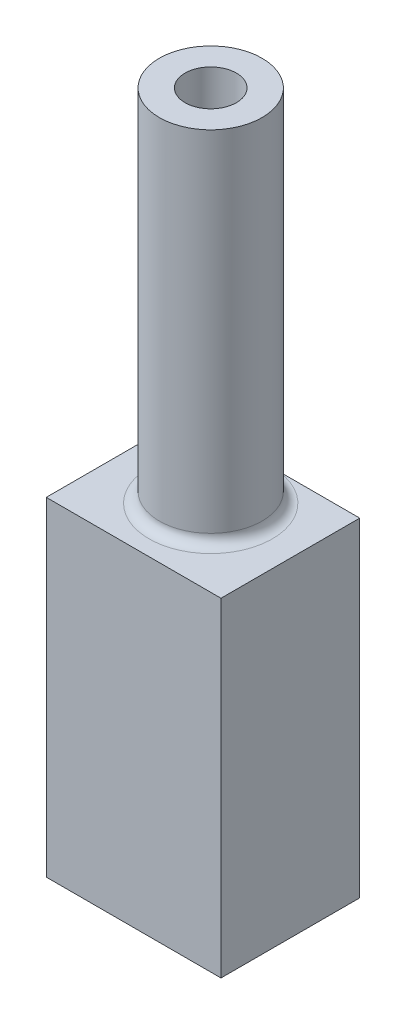
ISO-10303-21;
HEADER;
FILE_DESCRIPTION(('STEP AP214'),'2;1');
FILE_NAME('part.step','',(''),(''),'','','');
FILE_SCHEMA(('AUTOMOTIVE_DESIGN { 1 0 10303 214 1 1 1 1 }'));
ENDSEC;
DATA;
#1=APPLICATION_CONTEXT('core data for automotive mechanical design processes');
#2=APPLICATION_PROTOCOL_DEFINITION('international standard','automotive_design',2000,#1);
#3=PRODUCT_CONTEXT('',#1,'mechanical');
#4=PRODUCT('Part','Part','',(#3));
#5=PRODUCT_RELATED_PRODUCT_CATEGORY('part','',(#4));
#6=PRODUCT_DEFINITION_FORMATION('','',#4);
#7=PRODUCT_DEFINITION_CONTEXT('part definition',#1,'design');
#8=PRODUCT_DEFINITION('design','',#6,#7);
#9=PRODUCT_DEFINITION_SHAPE('','',#8);
#10=(LENGTH_UNIT() NAMED_UNIT(*) SI_UNIT(.MILLI.,.METRE.));
#11=(NAMED_UNIT(*) PLANE_ANGLE_UNIT() SI_UNIT($,.RADIAN.));
#12=(NAMED_UNIT(*) SI_UNIT($,.STERADIAN.) SOLID_ANGLE_UNIT());
#13=UNCERTAINTY_MEASURE_WITH_UNIT(LENGTH_MEASURE(1.E-05),#10,'distance_accuracy_value','');
#14=(GEOMETRIC_REPRESENTATION_CONTEXT(3) GLOBAL_UNCERTAINTY_ASSIGNED_CONTEXT((#13)) GLOBAL_UNIT_ASSIGNED_CONTEXT((#10,
#11,#12)) REPRESENTATION_CONTEXT('',''));
#15=CARTESIAN_POINT('',(0.,0.,0.));
#16=DIRECTION('',(0.,0.,1.));
#17=DIRECTION('',(1.,0.,0.));
#18=AXIS2_PLACEMENT_3D('',#15,#16,#17);
#19=CARTESIAN_POINT('',(8.5,-16.,6.));
#20=DIRECTION('',(-1.,0.,0.));
#21=DIRECTION('',(0.,0.,1.));
#22=AXIS2_PLACEMENT_3D('',#19,#20,#21);
#23=PLANE('',#22);
#24=DIRECTION('',(0.,1.,0.));
#25=VECTOR('',#24,1.);
#26=CARTESIAN_POINT('',(8.5,-16.,-6.));
#27=LINE('',#26,#25);
#28=CARTESIAN_POINT('',(8.5,-16.,-6.));
#29=VERTEX_POINT('',#28);
#30=CARTESIAN_POINT('',(8.5,16.,-6.));
#31=VERTEX_POINT('',#30);
#32=EDGE_CURVE('E161',#29,#31,#27,.T.);
#33=ORIENTED_EDGE('',*,*,#32,.T.);
#34=DIRECTION('',(0.,0.,-1.));
#35=VECTOR('',#34,1.);
#36=CARTESIAN_POINT('',(8.5,16.,6.));
#37=LINE('',#36,#35);
#38=CARTESIAN_POINT('',(8.5,16.,7.5));
#39=VERTEX_POINT('',#38);
#40=EDGE_CURVE('E207',#39,#31,#37,.T.);
#41=ORIENTED_EDGE('',*,*,#40,.F.);
#42=DIRECTION('',(0.,1.,0.));
#43=VECTOR('',#42,1.);
#44=CARTESIAN_POINT('',(8.5,16.,7.5));
#45=LINE('',#44,#43);
#46=CARTESIAN_POINT('',(8.5,-16.,7.5));
#47=VERTEX_POINT('',#46);
#48=EDGE_CURVE('E296',#47,#39,#45,.T.);
#49=ORIENTED_EDGE('',*,*,#48,.F.);
#50=DIRECTION('',(0.,0.,-1.));
#51=VECTOR('',#50,1.);
#52=CARTESIAN_POINT('',(8.5,-16.,6.));
#53=LINE('',#52,#51);
#54=EDGE_CURVE('E160',#47,#29,#53,.T.);
#55=ORIENTED_EDGE('',*,*,#54,.T.);
#56=EDGE_LOOP('',(#33,#41,#49,#55));
#57=FACE_BOUND('',#56,.T.);
#58=ADVANCED_FACE('F37',(#57),#23,.F.);
#59=CARTESIAN_POINT('',(-8.5,16.,6.));
#60=DIRECTION('',(0.,-1.,0.));
#61=DIRECTION('',(0.,0.,-1.));
#62=AXIS2_PLACEMENT_3D('',#59,#60,#61);
#63=PLANE('',#62);
#64=DIRECTION('',(-1.,0.,0.));
#65=VECTOR('',#64,1.);
#66=CARTESIAN_POINT('',(-8.5,16.,-6.));
#67=LINE('',#66,#65);
#68=CARTESIAN_POINT('',(0.,16.,-6.));
#69=VERTEX_POINT('',#68);
#70=EDGE_CURVE('E166',#31,#69,#67,.T.);
#71=ORIENTED_EDGE('',*,*,#70,.T.);
#72=CARTESIAN_POINT('',(0.,16.,0.));
#73=DIRECTION('',(0.,-1.,0.));
#74=DIRECTION('',(0.,0.,-1.));
#75=AXIS2_PLACEMENT_3D('',#72,#73,#74);
#76=CIRCLE('',#75,6.);
#77=EDGE_CURVE('E11',#69,#69,#76,.T.);
#78=ORIENTED_EDGE('',*,*,#77,.T.);
#79=CARTESIAN_POINT('',(-8.5,16.,-6.));
#80=VERTEX_POINT('',#79);
#81=EDGE_CURVE('E164',#69,#80,#67,.T.);
#82=ORIENTED_EDGE('',*,*,#81,.T.);
#83=DIRECTION('',(0.,0.,-1.));
#84=VECTOR('',#83,1.);
#85=CARTESIAN_POINT('',(-8.5,16.,6.));
#86=LINE('',#85,#84);
#87=CARTESIAN_POINT('',(-8.5,16.,7.5));
#88=VERTEX_POINT('',#87);
#89=EDGE_CURVE('E204',#88,#80,#86,.T.);
#90=ORIENTED_EDGE('',*,*,#89,.F.);
#91=DIRECTION('',(-1.,0.,0.));
#92=VECTOR('',#91,1.);
#93=CARTESIAN_POINT('',(-8.5,16.,7.5));
#94=LINE('',#93,#92);
#95=EDGE_CURVE('E299',#39,#88,#94,.T.);
#96=ORIENTED_EDGE('',*,*,#95,.F.);
#97=ORIENTED_EDGE('',*,*,#40,.T.);
#98=EDGE_LOOP('',(#71,#78,#82,#90,#96,#97));
#99=FACE_BOUND('',#98,.T.);
#100=ADVANCED_FACE('F227',(#99),#63,.F.);
#101=CARTESIAN_POINT('',(-8.5,-16.,6.));
#102=DIRECTION('',(1.,0.,0.));
#103=DIRECTION('',(0.,0.,-1.));
#104=AXIS2_PLACEMENT_3D('',#101,#102,#103);
#105=PLANE('',#104);
#106=DIRECTION('',(0.,-1.,0.));
#107=VECTOR('',#106,1.);
#108=CARTESIAN_POINT('',(-8.5,-16.,-6.));
#109=LINE('',#108,#107);
#110=CARTESIAN_POINT('',(-8.5,-16.,-6.));
#111=VERTEX_POINT('',#110);
#112=EDGE_CURVE('E168',#80,#111,#109,.T.);
#113=ORIENTED_EDGE('',*,*,#112,.T.);
#114=DIRECTION('',(0.,0.,-1.));
#115=VECTOR('',#114,1.);
#116=CARTESIAN_POINT('',(-8.5,-16.,6.));
#117=LINE('',#116,#115);
#118=CARTESIAN_POINT('',(-8.5,-16.,7.5));
#119=VERTEX_POINT('',#118);
#120=EDGE_CURVE('E201',#119,#111,#117,.T.);
#121=ORIENTED_EDGE('',*,*,#120,.F.);
#122=DIRECTION('',(0.,-1.,0.));
#123=VECTOR('',#122,1.);
#124=CARTESIAN_POINT('',(-8.5,16.,7.5));
#125=LINE('',#124,#123);
#126=EDGE_CURVE('E287',#88,#119,#125,.T.);
#127=ORIENTED_EDGE('',*,*,#126,.F.);
#128=ORIENTED_EDGE('',*,*,#89,.T.);
#129=EDGE_LOOP('',(#113,#121,#127,#128));
#130=FACE_BOUND('',#129,.T.);
#131=ADVANCED_FACE('F232',(#130),#105,.F.);
#132=CARTESIAN_POINT('',(-4.5,-14.,6.));
#133=DIRECTION('',(-1.,0.,0.));
#134=DIRECTION('',(0.,0.,1.));
#135=AXIS2_PLACEMENT_3D('',#132,#133,#134);
#136=PLANE('',#135);
#137=DIRECTION('',(0.,1.,0.));
#138=VECTOR('',#137,1.);
#139=CARTESIAN_POINT('',(-4.5,-14.,-6.));
#140=LINE('',#139,#138);
#141=CARTESIAN_POINT('',(-4.5,-16.,-6.));
#142=VERTEX_POINT('',#141);
#143=CARTESIAN_POINT('',(-4.5,-14.,-6.));
#144=VERTEX_POINT('',#143);
#145=EDGE_CURVE('E172',#142,#144,#140,.T.);
#146=ORIENTED_EDGE('',*,*,#145,.T.);
#147=DIRECTION('',(0.,0.,-1.));
#148=VECTOR('',#147,1.);
#149=CARTESIAN_POINT('',(-4.5,-14.,6.));
#150=LINE('',#149,#148);
#151=CARTESIAN_POINT('',(-4.5,-14.,6.));
#152=VERTEX_POINT('',#151);
#153=EDGE_CURVE('E197',#152,#144,#150,.T.);
#154=ORIENTED_EDGE('',*,*,#153,.F.);
#155=DIRECTION('',(0.,1.,0.));
#156=VECTOR('',#155,1.);
#157=CARTESIAN_POINT('',(-4.5,-14.,6.));
#158=LINE('',#157,#156);
#159=CARTESIAN_POINT('',(-4.5,-16.,6.));
#160=VERTEX_POINT('',#159);
#161=EDGE_CURVE('E186',#160,#152,#158,.T.);
#162=ORIENTED_EDGE('',*,*,#161,.F.);
#163=DIRECTION('',(0.,0.,-1.));
#164=VECTOR('',#163,1.);
#165=CARTESIAN_POINT('',(-4.5,-16.,6.));
#166=LINE('',#165,#164);
#167=EDGE_CURVE('E109',#160,#142,#166,.T.);
#168=ORIENTED_EDGE('',*,*,#167,.T.);
#169=EDGE_LOOP('',(#146,#154,#162,#168));
#170=FACE_BOUND('',#169,.T.);
#171=ADVANCED_FACE('F237',(#170),#136,.F.);
#172=CARTESIAN_POINT('',(-6.5,-14.,6.));
#173=DIRECTION('',(0.,-1.,0.));
#174=DIRECTION('',(0.,0.,-1.));
#175=AXIS2_PLACEMENT_3D('',#172,#173,#174);
#176=PLANE('',#175);
#177=DIRECTION('',(-1.,0.,0.));
#178=VECTOR('',#177,1.);
#179=CARTESIAN_POINT('',(-6.5,-14.,-6.));
#180=LINE('',#179,#178);
#181=CARTESIAN_POINT('',(-6.5,-14.,-6.));
#182=VERTEX_POINT('',#181);
#183=EDGE_CURVE('E174',#144,#182,#180,.T.);
#184=ORIENTED_EDGE('',*,*,#183,.T.);
#185=DIRECTION('',(0.,0.,-1.));
#186=VECTOR('',#185,1.);
#187=CARTESIAN_POINT('',(-6.5,-14.,6.));
#188=LINE('',#187,#186);
#189=CARTESIAN_POINT('',(-6.5,-14.,6.));
#190=VERTEX_POINT('',#189);
#191=EDGE_CURVE('E194',#190,#182,#188,.T.);
#192=ORIENTED_EDGE('',*,*,#191,.F.);
#193=DIRECTION('',(-1.,0.,0.));
#194=VECTOR('',#193,1.);
#195=CARTESIAN_POINT('',(-6.5,-14.,6.));
#196=LINE('',#195,#194);
#197=EDGE_CURVE('E306',#152,#190,#196,.T.);
#198=ORIENTED_EDGE('',*,*,#197,.F.);
#199=ORIENTED_EDGE('',*,*,#153,.T.);
#200=EDGE_LOOP('',(#184,#192,#198,#199));
#201=FACE_BOUND('',#200,.T.);
#202=ADVANCED_FACE('F241',(#201),#176,.F.);
#203=CARTESIAN_POINT('',(-6.5,-14.,6.));
#204=DIRECTION('',(-1.,0.,0.));
#205=DIRECTION('',(0.,0.,1.));
#206=AXIS2_PLACEMENT_3D('',#203,#204,#205);
#207=PLANE('',#206);
#208=DIRECTION('',(0.,1.,0.));
#209=VECTOR('',#208,1.);
#210=CARTESIAN_POINT('',(-6.5,-14.,-6.));
#211=LINE('',#210,#209);
#212=CARTESIAN_POINT('',(-6.5,14.,-6.));
#213=VERTEX_POINT('',#212);
#214=EDGE_CURVE('E176',#182,#213,#211,.T.);
#215=ORIENTED_EDGE('',*,*,#214,.T.);
#216=DIRECTION('',(0.,0.,-1.));
#217=VECTOR('',#216,1.);
#218=CARTESIAN_POINT('',(-6.5,14.,6.));
#219=LINE('',#218,#217);
#220=CARTESIAN_POINT('',(-6.5,14.,6.));
#221=VERTEX_POINT('',#220);
#222=EDGE_CURVE('E191',#221,#213,#219,.T.);
#223=ORIENTED_EDGE('',*,*,#222,.F.);
#224=DIRECTION('',(0.,1.,0.));
#225=VECTOR('',#224,1.);
#226=CARTESIAN_POINT('',(-6.5,-14.,6.));
#227=LINE('',#226,#225);
#228=EDGE_CURVE('E155',#190,#221,#227,.T.);
#229=ORIENTED_EDGE('',*,*,#228,.F.);
#230=ORIENTED_EDGE('',*,*,#191,.T.);
#231=EDGE_LOOP('',(#215,#223,#229,#230));
#232=FACE_BOUND('',#231,.T.);
#233=ADVANCED_FACE('F245',(#232),#207,.F.);
#234=CARTESIAN_POINT('',(-6.5,14.,6.));
#235=DIRECTION('',(0.,1.,0.));
#236=DIRECTION('',(0.,0.,1.));
#237=AXIS2_PLACEMENT_3D('',#234,#235,#236);
#238=PLANE('',#237);
#239=CARTESIAN_POINT('',(0.,14.,0.));
#240=DIRECTION('',(0.,1.,0.));
#241=DIRECTION('',(0.,0.,1.));
#242=AXIS2_PLACEMENT_3D('',#239,#240,#241);
#243=CIRCLE('',#242,2.5);
#244=CARTESIAN_POINT('',(0.,14.,2.5));
#245=VERTEX_POINT('',#244);
#246=EDGE_CURVE('E284',#245,#245,#243,.F.);
#247=ORIENTED_EDGE('',*,*,#246,.F.);
#248=EDGE_LOOP('',(#247));
#249=FACE_BOUND('',#248,.T.);
#250=DIRECTION('',(1.,0.,0.));
#251=VECTOR('',#250,1.);
#252=CARTESIAN_POINT('',(-6.5,14.,-6.));
#253=LINE('',#252,#251);
#254=CARTESIAN_POINT('',(6.5,14.,-6.));
#255=VERTEX_POINT('',#254);
#256=EDGE_CURVE('E178',#213,#255,#253,.T.);
#257=ORIENTED_EDGE('',*,*,#256,.T.);
#258=DIRECTION('',(0.,0.,-1.));
#259=VECTOR('',#258,1.);
#260=CARTESIAN_POINT('',(6.5,14.,6.));
#261=LINE('',#260,#259);
#262=CARTESIAN_POINT('',(6.5,14.,6.));
#263=VERTEX_POINT('',#262);
#264=EDGE_CURVE('E139',#263,#255,#261,.T.);
#265=ORIENTED_EDGE('',*,*,#264,.F.);
#266=DIRECTION('',(1.,0.,0.));
#267=VECTOR('',#266,1.);
#268=CARTESIAN_POINT('',(-6.5,14.,6.));
#269=LINE('',#268,#267);
#270=EDGE_CURVE('E153',#221,#263,#269,.T.);
#271=ORIENTED_EDGE('',*,*,#270,.F.);
#272=ORIENTED_EDGE('',*,*,#222,.T.);
#273=EDGE_LOOP('',(#257,#265,#271,#272));
#274=FACE_BOUND('',#273,.T.);
#275=ADVANCED_FACE('F249',(#249,#274),#238,.F.);
#276=CARTESIAN_POINT('',(6.5,-14.,6.));
#277=DIRECTION('',(1.,0.,0.));
#278=DIRECTION('',(0.,0.,-1.));
#279=AXIS2_PLACEMENT_3D('',#276,#277,#278);
#280=PLANE('',#279);
#281=DIRECTION('',(0.,-1.,0.));
#282=VECTOR('',#281,1.);
#283=CARTESIAN_POINT('',(6.5,-14.,-6.));
#284=LINE('',#283,#282);
#285=CARTESIAN_POINT('',(6.5,-14.,-6.));
#286=VERTEX_POINT('',#285);
#287=EDGE_CURVE('E136',#255,#286,#284,.T.);
#288=ORIENTED_EDGE('',*,*,#287,.T.);
#289=DIRECTION('',(0.,0.,-1.));
#290=VECTOR('',#289,1.);
#291=CARTESIAN_POINT('',(6.5,-14.,6.));
#292=LINE('',#291,#290);
#293=CARTESIAN_POINT('',(6.5,-14.,6.));
#294=VERTEX_POINT('',#293);
#295=EDGE_CURVE('E128',#294,#286,#292,.T.);
#296=ORIENTED_EDGE('',*,*,#295,.F.);
#297=DIRECTION('',(0.,-1.,0.));
#298=VECTOR('',#297,1.);
#299=CARTESIAN_POINT('',(6.5,-14.,6.));
#300=LINE('',#299,#298);
#301=EDGE_CURVE('E133',#263,#294,#300,.T.);
#302=ORIENTED_EDGE('',*,*,#301,.F.);
#303=ORIENTED_EDGE('',*,*,#264,.T.);
#304=EDGE_LOOP('',(#288,#296,#302,#303));
#305=FACE_BOUND('',#304,.T.);
#306=ADVANCED_FACE('F130',(#305),#280,.F.);
#307=CARTESIAN_POINT('',(4.5,-14.,6.));
#308=DIRECTION('',(0.,-1.,0.));
#309=DIRECTION('',(0.,0.,-1.));
#310=AXIS2_PLACEMENT_3D('',#307,#308,#309);
#311=PLANE('',#310);
#312=DIRECTION('',(-1.,0.,0.));
#313=VECTOR('',#312,1.);
#314=CARTESIAN_POINT('',(4.5,-14.,-6.));
#315=LINE('',#314,#313);
#316=CARTESIAN_POINT('',(4.5,-14.,-6.));
#317=VERTEX_POINT('',#316);
#318=EDGE_CURVE('E181',#286,#317,#315,.T.);
#319=ORIENTED_EDGE('',*,*,#318,.T.);
#320=DIRECTION('',(0.,0.,-1.));
#321=VECTOR('',#320,1.);
#322=CARTESIAN_POINT('',(4.5,-14.,6.));
#323=LINE('',#322,#321);
#324=CARTESIAN_POINT('',(4.5,-14.,6.));
#325=VERTEX_POINT('',#324);
#326=EDGE_CURVE('E140',#325,#317,#323,.T.);
#327=ORIENTED_EDGE('',*,*,#326,.F.);
#328=DIRECTION('',(-1.,0.,0.));
#329=VECTOR('',#328,1.);
#330=CARTESIAN_POINT('',(4.5,-14.,6.));
#331=LINE('',#330,#329);
#332=EDGE_CURVE('E143',#294,#325,#331,.T.);
#333=ORIENTED_EDGE('',*,*,#332,.F.);
#334=ORIENTED_EDGE('',*,*,#295,.T.);
#335=EDGE_LOOP('',(#319,#327,#333,#334));
#336=FACE_BOUND('',#335,.T.);
#337=ADVANCED_FACE('F144',(#336),#311,.F.);
#338=CARTESIAN_POINT('',(4.5,-14.,6.));
#339=DIRECTION('',(1.,0.,0.));
#340=DIRECTION('',(0.,0.,-1.));
#341=AXIS2_PLACEMENT_3D('',#338,#339,#340);
#342=PLANE('',#341);
#343=DIRECTION('',(0.,-1.,0.));
#344=VECTOR('',#343,1.);
#345=CARTESIAN_POINT('',(4.5,-14.,-6.));
#346=LINE('',#345,#344);
#347=CARTESIAN_POINT('',(4.5,-16.,-6.));
#348=VERTEX_POINT('',#347);
#349=EDGE_CURVE('E183',#317,#348,#346,.T.);
#350=ORIENTED_EDGE('',*,*,#349,.T.);
#351=DIRECTION('',(0.,0.,-1.));
#352=VECTOR('',#351,1.);
#353=CARTESIAN_POINT('',(4.5,-16.,6.));
#354=LINE('',#353,#352);
#355=CARTESIAN_POINT('',(4.5,-16.,6.));
#356=VERTEX_POINT('',#355);
#357=EDGE_CURVE('E58',#356,#348,#354,.T.);
#358=ORIENTED_EDGE('',*,*,#357,.F.);
#359=DIRECTION('',(0.,-1.,0.));
#360=VECTOR('',#359,1.);
#361=CARTESIAN_POINT('',(4.5,-14.,6.));
#362=LINE('',#361,#360);
#363=EDGE_CURVE('E147',#325,#356,#362,.T.);
#364=ORIENTED_EDGE('',*,*,#363,.F.);
#365=ORIENTED_EDGE('',*,*,#326,.T.);
#366=EDGE_LOOP('',(#350,#358,#364,#365));
#367=FACE_BOUND('',#366,.T.);
#368=ADVANCED_FACE('F258',(#367),#342,.F.);
#369=CARTESIAN_POINT('',(4.5,-16.,6.));
#370=DIRECTION('',(0.,1.,0.));
#371=DIRECTION('',(0.,0.,1.));
#372=AXIS2_PLACEMENT_3D('',#369,#370,#371);
#373=PLANE('',#372);
#374=DIRECTION('',(1.,0.,0.));
#375=VECTOR('',#374,1.);
#376=CARTESIAN_POINT('',(4.5,-16.,-6.));
#377=LINE('',#376,#375);
#378=EDGE_CURVE('E102',#348,#29,#377,.T.);
#379=ORIENTED_EDGE('',*,*,#378,.T.);
#380=ORIENTED_EDGE('',*,*,#54,.F.);
#381=DIRECTION('',(1.,0.,0.));
#382=VECTOR('',#381,1.);
#383=CARTESIAN_POINT('',(-8.5,-16.,7.5));
#384=LINE('',#383,#382);
#385=EDGE_CURVE('E293',#119,#47,#384,.T.);
#386=ORIENTED_EDGE('',*,*,#385,.F.);
#387=ORIENTED_EDGE('',*,*,#120,.T.);
#388=DIRECTION('',(1.,0.,0.));
#389=VECTOR('',#388,1.);
#390=CARTESIAN_POINT('',(-8.5,-16.,-6.));
#391=LINE('',#390,#389);
#392=EDGE_CURVE('E170',#111,#142,#391,.T.);
#393=ORIENTED_EDGE('',*,*,#392,.T.);
#394=ORIENTED_EDGE('',*,*,#167,.F.);
#395=DIRECTION('',(1.,0.,0.));
#396=VECTOR('',#395,1.);
#397=CARTESIAN_POINT('',(-8.5,-16.,6.));
#398=LINE('',#397,#396);
#399=EDGE_CURVE('E285',#160,#356,#398,.T.);
#400=ORIENTED_EDGE('',*,*,#399,.T.);
#401=ORIENTED_EDGE('',*,*,#357,.T.);
#402=EDGE_LOOP('',(#379,#380,#386,#387,#393,#394,#400,#401));
#403=FACE_BOUND('',#402,.T.);
#404=ADVANCED_FACE('F261',(#403),#373,.F.);
#405=CARTESIAN_POINT('',(0.,0.,-6.));
#406=DIRECTION('',(0.,0.,-1.));
#407=DIRECTION('',(-1.,0.,0.));
#408=AXIS2_PLACEMENT_3D('',#405,#406,#407);
#409=PLANE('',#408);
#410=ORIENTED_EDGE('',*,*,#32,.F.);
#411=ORIENTED_EDGE('',*,*,#378,.F.);
#412=ORIENTED_EDGE('',*,*,#349,.F.);
#413=ORIENTED_EDGE('',*,*,#318,.F.);
#414=ORIENTED_EDGE('',*,*,#287,.F.);
#415=ORIENTED_EDGE('',*,*,#256,.F.);
#416=ORIENTED_EDGE('',*,*,#214,.F.);
#417=ORIENTED_EDGE('',*,*,#183,.F.);
#418=ORIENTED_EDGE('',*,*,#145,.F.);
#419=ORIENTED_EDGE('',*,*,#392,.F.);
#420=ORIENTED_EDGE('',*,*,#112,.F.);
#421=ORIENTED_EDGE('',*,*,#81,.F.);
#422=ORIENTED_EDGE('',*,*,#70,.F.);
#423=EDGE_LOOP('',(#410,#411,#412,#413,#414,#415,#416,#417,#418,#419,#420,#421,#422));
#424=FACE_BOUND('',#423,.T.);
#425=ADVANCED_FACE('F264',(#424),#409,.T.);
#426=CARTESIAN_POINT('',(0.,51.,0.));
#427=DIRECTION('',(0.,-1.,0.));
#428=DIRECTION('',(0.,0.,-1.));
#429=AXIS2_PLACEMENT_3D('',#426,#427,#428);
#430=CYLINDRICAL_SURFACE('',#429,5.);
#431=CARTESIAN_POINT('',(0.,17.,0.));
#432=DIRECTION('',(0.,-1.,0.));
#433=DIRECTION('',(0.,0.,-1.));
#434=AXIS2_PLACEMENT_3D('',#431,#432,#433);
#435=CIRCLE('',#434,5.);
#436=CARTESIAN_POINT('',(0.,17.,-5.));
#437=VERTEX_POINT('',#436);
#438=EDGE_CURVE('E45',#437,#437,#435,.F.);
#439=ORIENTED_EDGE('',*,*,#438,.T.);
#440=EDGE_LOOP('',(#439));
#441=FACE_BOUND('',#440,.T.);
#442=CARTESIAN_POINT('',(0.,51.,0.));
#443=DIRECTION('',(0.,1.,0.));
#444=DIRECTION('',(0.,0.,1.));
#445=AXIS2_PLACEMENT_3D('',#442,#443,#444);
#446=CIRCLE('',#445,5.);
#447=CARTESIAN_POINT('',(0.,51.,5.));
#448=VERTEX_POINT('',#447);
#449=EDGE_CURVE('E165',#448,#448,#446,.T.);
#450=ORIENTED_EDGE('',*,*,#449,.F.);
#451=EDGE_LOOP('',(#450));
#452=FACE_BOUND('',#451,.T.);
#453=ADVANCED_FACE('F212',(#441,#452),#430,.T.);
#454=CARTESIAN_POINT('',(0.,51.,0.));
#455=DIRECTION('',(0.,1.,0.));
#456=DIRECTION('',(0.,0.,1.));
#457=AXIS2_PLACEMENT_3D('',#454,#455,#456);
#458=PLANE('',#457);
#459=CARTESIAN_POINT('',(0.,51.,0.));
#460=DIRECTION('',(0.,1.,0.));
#461=DIRECTION('',(0.,0.,1.));
#462=AXIS2_PLACEMENT_3D('',#459,#460,#461);
#463=CIRCLE('',#462,2.5);
#464=CARTESIAN_POINT('',(0.,51.,2.5));
#465=VERTEX_POINT('',#464);
#466=EDGE_CURVE('E281',#465,#465,#463,.T.);
#467=ORIENTED_EDGE('',*,*,#466,.F.);
#468=EDGE_LOOP('',(#467));
#469=FACE_BOUND('',#468,.T.);
#470=ORIENTED_EDGE('',*,*,#449,.T.);
#471=EDGE_LOOP('',(#470));
#472=FACE_BOUND('',#471,.T.);
#473=ADVANCED_FACE('F216',(#469,#472),#458,.T.);
#474=CARTESIAN_POINT('',(0.,17.,0.));
#475=DIRECTION('',(0.,-1.,0.));
#476=DIRECTION('',(0.,0.,-1.));
#477=AXIS2_PLACEMENT_3D('',#474,#475,#476);
#478=TOROIDAL_SURFACE('',#477,6.,1.);
#479=ORIENTED_EDGE('',*,*,#77,.F.);
#480=EDGE_LOOP('',(#479));
#481=FACE_BOUND('',#480,.T.);
#482=ORIENTED_EDGE('',*,*,#438,.F.);
#483=EDGE_LOOP('',(#482));
#484=FACE_BOUND('',#483,.T.);
#485=ADVANCED_FACE('F39',(#481,#484),#478,.F.);
#486=CARTESIAN_POINT('',(0.,0.,6.));
#487=DIRECTION('',(0.,0.,1.));
#488=DIRECTION('',(1.,0.,0.));
#489=AXIS2_PLACEMENT_3D('',#486,#487,#488);
#490=PLANE('',#489);
#491=ORIENTED_EDGE('',*,*,#399,.F.);
#492=ORIENTED_EDGE('',*,*,#161,.T.);
#493=ORIENTED_EDGE('',*,*,#197,.T.);
#494=ORIENTED_EDGE('',*,*,#228,.T.);
#495=ORIENTED_EDGE('',*,*,#270,.T.);
#496=ORIENTED_EDGE('',*,*,#301,.T.);
#497=ORIENTED_EDGE('',*,*,#332,.T.);
#498=ORIENTED_EDGE('',*,*,#363,.T.);
#499=EDGE_LOOP('',(#491,#492,#493,#494,#495,#496,#497,#498));
#500=FACE_BOUND('',#499,.T.);
#501=ADVANCED_FACE('F150',(#500),#490,.F.);
#502=CARTESIAN_POINT('',(0.,0.,7.5));
#503=DIRECTION('',(0.,0.,1.));
#504=DIRECTION('',(1.,0.,0.));
#505=AXIS2_PLACEMENT_3D('',#502,#503,#504);
#506=PLANE('',#505);
#507=ORIENTED_EDGE('',*,*,#126,.T.);
#508=ORIENTED_EDGE('',*,*,#385,.T.);
#509=ORIENTED_EDGE('',*,*,#48,.T.);
#510=ORIENTED_EDGE('',*,*,#95,.T.);
#511=EDGE_LOOP('',(#507,#508,#509,#510));
#512=FACE_BOUND('',#511,.T.);
#513=ADVANCED_FACE('F222',(#512),#506,.T.);
#514=CARTESIAN_POINT('',(0.,-16.001,0.));
#515=DIRECTION('',(0.,1.,0.));
#516=DIRECTION('',(0.,0.,1.));
#517=AXIS2_PLACEMENT_3D('',#514,#515,#516);
#518=CYLINDRICAL_SURFACE('',#517,2.5);
#519=ORIENTED_EDGE('',*,*,#466,.T.);
#520=EDGE_LOOP('',(#519));
#521=FACE_BOUND('',#520,.T.);
#522=ORIENTED_EDGE('',*,*,#246,.T.);
#523=EDGE_LOOP('',(#522));
#524=FACE_BOUND('',#523,.T.);
#525=ADVANCED_FACE('F272',(#521,#524),#518,.F.);
#526=CLOSED_SHELL('',(#58,#100,#131,#171,#202,#233,#275,#306,#337,#368,#404,#425,#453,#473,#485,
#501,#513,#525));
#527=MANIFOLD_SOLID_BREP('B2',#526);
#528=ADVANCED_BREP_SHAPE_REPRESENTATION('',(#18,#527),#14);
#529=SHAPE_DEFINITION_REPRESENTATION(#9,#528);
ENDSEC;
END-ISO-10303-21;
